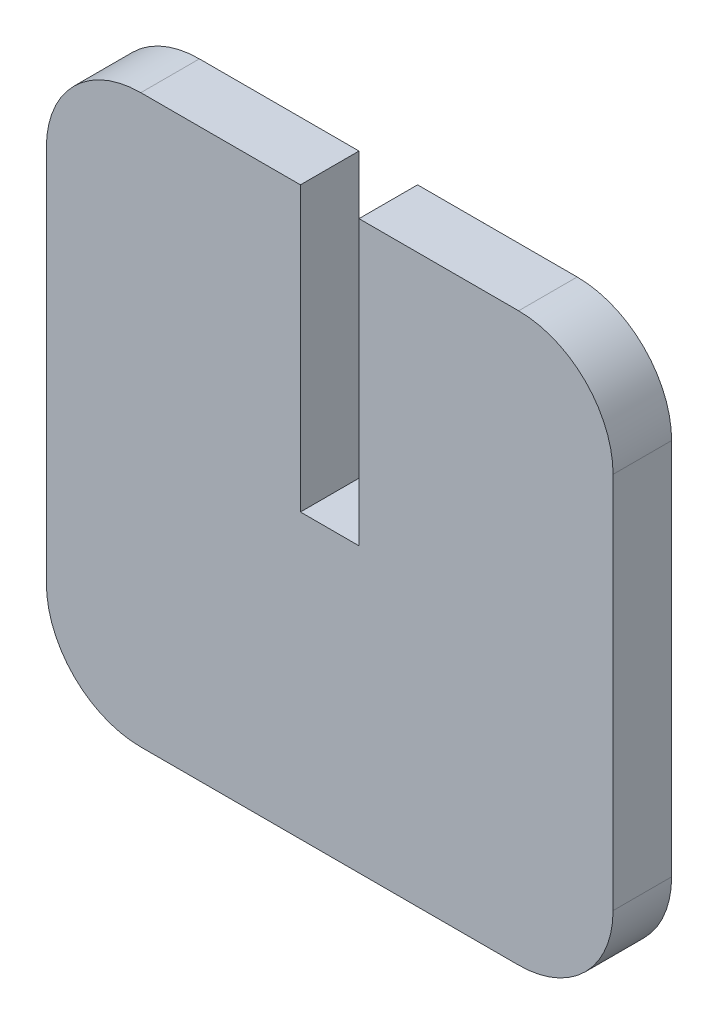
ISO-10303-21;
HEADER;
FILE_DESCRIPTION(('STEP AP214'),'2;1');
FILE_NAME('part.step','',(''),(''),'','','');
FILE_SCHEMA(('AUTOMOTIVE_DESIGN { 1 0 10303 214 1 1 1 1 }'));
ENDSEC;
DATA;
#1=APPLICATION_CONTEXT('core data for automotive mechanical design processes');
#2=APPLICATION_PROTOCOL_DEFINITION('international standard','automotive_design',2000,#1);
#3=PRODUCT_CONTEXT('',#1,'mechanical');
#4=PRODUCT('Part','Part','',(#3));
#5=PRODUCT_RELATED_PRODUCT_CATEGORY('part','',(#4));
#6=PRODUCT_DEFINITION_FORMATION('','',#4);
#7=PRODUCT_DEFINITION_CONTEXT('part definition',#1,'design');
#8=PRODUCT_DEFINITION('design','',#6,#7);
#9=PRODUCT_DEFINITION_SHAPE('','',#8);
#10=(LENGTH_UNIT() NAMED_UNIT(*) SI_UNIT(.MILLI.,.METRE.));
#11=(NAMED_UNIT(*) PLANE_ANGLE_UNIT() SI_UNIT($,.RADIAN.));
#12=(NAMED_UNIT(*) SI_UNIT($,.STERADIAN.) SOLID_ANGLE_UNIT());
#13=UNCERTAINTY_MEASURE_WITH_UNIT(LENGTH_MEASURE(1.E-05),#10,'distance_accuracy_value','');
#14=(GEOMETRIC_REPRESENTATION_CONTEXT(3) GLOBAL_UNCERTAINTY_ASSIGNED_CONTEXT((#13)) GLOBAL_UNIT_ASSIGNED_CONTEXT((#10,
#11,#12)) REPRESENTATION_CONTEXT('',''));
#15=CARTESIAN_POINT('',(0.,0.,0.));
#16=DIRECTION('',(0.,0.,1.));
#17=DIRECTION('',(1.,0.,0.));
#18=AXIS2_PLACEMENT_3D('',#15,#16,#17);
#19=CARTESIAN_POINT('',(-15.,15.,3.1));
#20=DIRECTION('',(0.,-1.,0.));
#21=DIRECTION('',(0.,0.,-1.));
#22=AXIS2_PLACEMENT_3D('',#19,#20,#21);
#23=PLANE('',#22);
#24=DIRECTION('',(-1.,0.,0.));
#25=VECTOR('',#24,1.);
#26=CARTESIAN_POINT('',(-15.,15.,3.1));
#27=LINE('',#26,#25);
#28=CARTESIAN_POINT('',(10.,15.,3.1));
#29=VERTEX_POINT('',#28);
#30=CARTESIAN_POINT('',(1.55,15.,3.1));
#31=VERTEX_POINT('',#30);
#32=EDGE_CURVE('E158',#29,#31,#27,.T.);
#33=ORIENTED_EDGE('',*,*,#32,.F.);
#34=DIRECTION('',(0.,0.,-1.));
#35=VECTOR('',#34,1.);
#36=CARTESIAN_POINT('',(10.,15.,3.1));
#37=LINE('',#36,#35);
#38=CARTESIAN_POINT('',(10.,15.,0.));
#39=VERTEX_POINT('',#38);
#40=EDGE_CURVE('E199',#29,#39,#37,.T.);
#41=ORIENTED_EDGE('',*,*,#40,.T.);
#42=DIRECTION('',(-1.,0.,0.));
#43=VECTOR('',#42,1.);
#44=CARTESIAN_POINT('',(-15.,15.,0.));
#45=LINE('',#44,#43);
#46=CARTESIAN_POINT('',(1.55,15.,0.));
#47=VERTEX_POINT('',#46);
#48=EDGE_CURVE('E169',#39,#47,#45,.T.);
#49=ORIENTED_EDGE('',*,*,#48,.T.);
#50=DIRECTION('',(0.,0.,-1.));
#51=VECTOR('',#50,1.);
#52=CARTESIAN_POINT('',(1.55,15.,3.1));
#53=LINE('',#52,#51);
#54=EDGE_CURVE('E235',#31,#47,#53,.T.);
#55=ORIENTED_EDGE('',*,*,#54,.F.);
#56=EDGE_LOOP('',(#33,#41,#49,#55));
#57=FACE_BOUND('',#56,.T.);
#58=ADVANCED_FACE('F32',(#57),#23,.F.);
#59=CARTESIAN_POINT('',(15.,-15.,3.1));
#60=DIRECTION('',(-1.,0.,0.));
#61=DIRECTION('',(0.,0.,1.));
#62=AXIS2_PLACEMENT_3D('',#59,#60,#61);
#63=PLANE('',#62);
#64=DIRECTION('',(0.,1.,0.));
#65=VECTOR('',#64,1.);
#66=CARTESIAN_POINT('',(15.,-15.,3.1));
#67=LINE('',#66,#65);
#68=CARTESIAN_POINT('',(15.,-10.,3.1));
#69=VERTEX_POINT('',#68);
#70=CARTESIAN_POINT('',(15.,10.,3.1));
#71=VERTEX_POINT('',#70);
#72=EDGE_CURVE('E153',#69,#71,#67,.T.);
#73=ORIENTED_EDGE('',*,*,#72,.F.);
#74=DIRECTION('',(0.,0.,-1.));
#75=VECTOR('',#74,1.);
#76=CARTESIAN_POINT('',(15.,-10.,3.1));
#77=LINE('',#76,#75);
#78=CARTESIAN_POINT('',(15.,-10.,0.));
#79=VERTEX_POINT('',#78);
#80=EDGE_CURVE('E176',#69,#79,#77,.T.);
#81=ORIENTED_EDGE('',*,*,#80,.T.);
#82=DIRECTION('',(0.,1.,0.));
#83=VECTOR('',#82,1.);
#84=CARTESIAN_POINT('',(15.,-15.,0.));
#85=LINE('',#84,#83);
#86=CARTESIAN_POINT('',(15.,10.,0.));
#87=VERTEX_POINT('',#86);
#88=EDGE_CURVE('E166',#79,#87,#85,.T.);
#89=ORIENTED_EDGE('',*,*,#88,.T.);
#90=DIRECTION('',(0.,0.,-1.));
#91=VECTOR('',#90,1.);
#92=CARTESIAN_POINT('',(15.,10.,3.1));
#93=LINE('',#92,#91);
#94=EDGE_CURVE('E165',#87,#71,#93,.F.);
#95=ORIENTED_EDGE('',*,*,#94,.T.);
#96=EDGE_LOOP('',(#73,#81,#89,#95));
#97=FACE_BOUND('',#96,.T.);
#98=ADVANCED_FACE('F224',(#97),#63,.F.);
#99=CARTESIAN_POINT('',(-1.55,15.,0.));
#100=VERTEX_POINT('',#99);
#101=CARTESIAN_POINT('',(-10.,15.,0.));
#102=VERTEX_POINT('',#101);
#103=EDGE_CURVE('E145',#100,#102,#45,.T.);
#104=ORIENTED_EDGE('',*,*,#103,.T.);
#105=DIRECTION('',(0.,0.,-1.));
#106=VECTOR('',#105,1.);
#107=CARTESIAN_POINT('',(-10.,15.,3.1));
#108=LINE('',#107,#106);
#109=CARTESIAN_POINT('',(-10.,15.,3.1));
#110=VERTEX_POINT('',#109);
#111=EDGE_CURVE('E11',#102,#110,#108,.F.);
#112=ORIENTED_EDGE('',*,*,#111,.T.);
#113=CARTESIAN_POINT('',(-1.55,15.,3.1));
#114=VERTEX_POINT('',#113);
#115=EDGE_CURVE('E156',#114,#110,#27,.T.);
#116=ORIENTED_EDGE('',*,*,#115,.F.);
#117=DIRECTION('',(0.,0.,1.));
#118=VECTOR('',#117,1.);
#119=CARTESIAN_POINT('',(-1.55,15.,3.1));
#120=LINE('',#119,#118);
#121=EDGE_CURVE('E241',#100,#114,#120,.T.);
#122=ORIENTED_EDGE('',*,*,#121,.F.);
#123=EDGE_LOOP('',(#104,#112,#116,#122));
#124=FACE_BOUND('',#123,.T.);
#125=ADVANCED_FACE('F247',(#124),#23,.F.);
#126=CARTESIAN_POINT('',(-15.,-15.,3.1));
#127=DIRECTION('',(1.,0.,0.));
#128=DIRECTION('',(0.,0.,-1.));
#129=AXIS2_PLACEMENT_3D('',#126,#127,#128);
#130=PLANE('',#129);
#131=DIRECTION('',(0.,-1.,0.));
#132=VECTOR('',#131,1.);
#133=CARTESIAN_POINT('',(-15.,-15.,0.));
#134=LINE('',#133,#132);
#135=CARTESIAN_POINT('',(-15.,10.,0.));
#136=VERTEX_POINT('',#135);
#137=CARTESIAN_POINT('',(-15.,-10.,0.));
#138=VERTEX_POINT('',#137);
#139=EDGE_CURVE('E171',#136,#138,#134,.T.);
#140=ORIENTED_EDGE('',*,*,#139,.T.);
#141=DIRECTION('',(0.,0.,-1.));
#142=VECTOR('',#141,1.);
#143=CARTESIAN_POINT('',(-15.,-10.,3.1));
#144=LINE('',#143,#142);
#145=CARTESIAN_POINT('',(-15.,-10.,3.1));
#146=VERTEX_POINT('',#145);
#147=EDGE_CURVE('E40',#138,#146,#144,.F.);
#148=ORIENTED_EDGE('',*,*,#147,.T.);
#149=DIRECTION('',(0.,-1.,0.));
#150=VECTOR('',#149,1.);
#151=CARTESIAN_POINT('',(-15.,-15.,3.1));
#152=LINE('',#151,#150);
#153=CARTESIAN_POINT('',(-15.,10.,3.1));
#154=VERTEX_POINT('',#153);
#155=EDGE_CURVE('E160',#154,#146,#152,.T.);
#156=ORIENTED_EDGE('',*,*,#155,.F.);
#157=DIRECTION('',(0.,0.,-1.));
#158=VECTOR('',#157,1.);
#159=CARTESIAN_POINT('',(-15.,10.,3.1));
#160=LINE('',#159,#158);
#161=EDGE_CURVE('E202',#154,#136,#160,.T.);
#162=ORIENTED_EDGE('',*,*,#161,.T.);
#163=EDGE_LOOP('',(#140,#148,#156,#162));
#164=FACE_BOUND('',#163,.T.);
#165=ADVANCED_FACE('F206',(#164),#130,.F.);
#166=CARTESIAN_POINT('',(-15.,-15.,3.1));
#167=DIRECTION('',(0.,1.,0.));
#168=DIRECTION('',(0.,0.,1.));
#169=AXIS2_PLACEMENT_3D('',#166,#167,#168);
#170=PLANE('',#169);
#171=DIRECTION('',(1.,0.,0.));
#172=VECTOR('',#171,1.);
#173=CARTESIAN_POINT('',(-15.,-15.,0.));
#174=LINE('',#173,#172);
#175=CARTESIAN_POINT('',(-10.,-15.,0.));
#176=VERTEX_POINT('',#175);
#177=CARTESIAN_POINT('',(10.,-15.,0.));
#178=VERTEX_POINT('',#177);
#179=EDGE_CURVE('E157',#176,#178,#174,.T.);
#180=ORIENTED_EDGE('',*,*,#179,.T.);
#181=DIRECTION('',(0.,0.,-1.));
#182=VECTOR('',#181,1.);
#183=CARTESIAN_POINT('',(10.,-15.,3.1));
#184=LINE('',#183,#182);
#185=CARTESIAN_POINT('',(10.,-15.,3.1));
#186=VERTEX_POINT('',#185);
#187=EDGE_CURVE('E190',#178,#186,#184,.F.);
#188=ORIENTED_EDGE('',*,*,#187,.T.);
#189=DIRECTION('',(1.,0.,0.));
#190=VECTOR('',#189,1.);
#191=CARTESIAN_POINT('',(-15.,-15.,3.1));
#192=LINE('',#191,#190);
#193=CARTESIAN_POINT('',(-10.,-15.,3.1));
#194=VERTEX_POINT('',#193);
#195=EDGE_CURVE('E162',#194,#186,#192,.T.);
#196=ORIENTED_EDGE('',*,*,#195,.F.);
#197=DIRECTION('',(0.,0.,-1.));
#198=VECTOR('',#197,1.);
#199=CARTESIAN_POINT('',(-10.,-15.,3.1));
#200=LINE('',#199,#198);
#201=EDGE_CURVE('E187',#194,#176,#200,.T.);
#202=ORIENTED_EDGE('',*,*,#201,.T.);
#203=EDGE_LOOP('',(#180,#188,#196,#202));
#204=FACE_BOUND('',#203,.T.);
#205=ADVANCED_FACE('F215',(#204),#170,.F.);
#206=CARTESIAN_POINT('',(0.,0.,3.1));
#207=DIRECTION('',(0.,0.,-1.));
#208=DIRECTION('',(-1.,0.,0.));
#209=AXIS2_PLACEMENT_3D('',#206,#207,#208);
#210=PLANE('',#209);
#211=ORIENTED_EDGE('',*,*,#195,.T.);
#212=CARTESIAN_POINT('',(10.,-10.,3.1));
#213=DIRECTION('',(0.,0.,-1.));
#214=DIRECTION('',(-1.,0.,0.));
#215=AXIS2_PLACEMENT_3D('',#212,#213,#214);
#216=CIRCLE('',#215,5.);
#217=EDGE_CURVE('E197',#186,#69,#216,.F.);
#218=ORIENTED_EDGE('',*,*,#217,.T.);
#219=ORIENTED_EDGE('',*,*,#72,.T.);
#220=CARTESIAN_POINT('',(10.,10.,3.1));
#221=DIRECTION('',(0.,0.,-1.));
#222=DIRECTION('',(-1.,0.,0.));
#223=AXIS2_PLACEMENT_3D('',#220,#221,#222);
#224=CIRCLE('',#223,5.);
#225=EDGE_CURVE('E195',#71,#29,#224,.F.);
#226=ORIENTED_EDGE('',*,*,#225,.T.);
#227=ORIENTED_EDGE('',*,*,#32,.T.);
#228=DIRECTION('',(0.,1.,0.));
#229=VECTOR('',#228,1.);
#230=CARTESIAN_POINT('',(1.55,0.,3.1));
#231=LINE('',#230,#229);
#232=CARTESIAN_POINT('',(1.55,0.,3.1));
#233=VERTEX_POINT('',#232);
#234=EDGE_CURVE('E148',#233,#31,#231,.T.);
#235=ORIENTED_EDGE('',*,*,#234,.F.);
#236=DIRECTION('',(1.,0.,0.));
#237=VECTOR('',#236,1.);
#238=CARTESIAN_POINT('',(-1.55,0.,3.1));
#239=LINE('',#238,#237);
#240=CARTESIAN_POINT('',(-1.55,0.,3.1));
#241=VERTEX_POINT('',#240);
#242=EDGE_CURVE('E131',#241,#233,#239,.T.);
#243=ORIENTED_EDGE('',*,*,#242,.F.);
#244=DIRECTION('',(0.,1.,0.));
#245=VECTOR('',#244,1.);
#246=CARTESIAN_POINT('',(-1.55,0.,3.1));
#247=LINE('',#246,#245);
#248=EDGE_CURVE('E127',#241,#114,#247,.T.);
#249=ORIENTED_EDGE('',*,*,#248,.T.);
#250=ORIENTED_EDGE('',*,*,#115,.T.);
#251=CARTESIAN_POINT('',(-10.,10.,3.1));
#252=DIRECTION('',(0.,0.,-1.));
#253=DIRECTION('',(-1.,0.,0.));
#254=AXIS2_PLACEMENT_3D('',#251,#252,#253);
#255=CIRCLE('',#254,5.);
#256=EDGE_CURVE('E53',#110,#154,#255,.F.);
#257=ORIENTED_EDGE('',*,*,#256,.T.);
#258=ORIENTED_EDGE('',*,*,#155,.T.);
#259=CARTESIAN_POINT('',(-10.,-10.,3.1));
#260=DIRECTION('',(0.,0.,-1.));
#261=DIRECTION('',(-1.,0.,0.));
#262=AXIS2_PLACEMENT_3D('',#259,#260,#261);
#263=CIRCLE('',#262,5.);
#264=EDGE_CURVE('E193',#146,#194,#263,.F.);
#265=ORIENTED_EDGE('',*,*,#264,.T.);
#266=EDGE_LOOP('',(#211,#218,#219,#226,#227,#235,#243,#249,#250,#257,#258,#265));
#267=FACE_BOUND('',#266,.T.);
#268=ADVANCED_FACE('F218',(#267),#210,.F.);
#269=CARTESIAN_POINT('',(0.,0.,0.));
#270=DIRECTION('',(0.,0.,-1.));
#271=DIRECTION('',(-1.,0.,0.));
#272=AXIS2_PLACEMENT_3D('',#269,#270,#271);
#273=PLANE('',#272);
#274=ORIENTED_EDGE('',*,*,#88,.F.);
#275=CARTESIAN_POINT('',(10.,-10.,0.));
#276=DIRECTION('',(0.,0.,-1.));
#277=DIRECTION('',(-1.,0.,0.));
#278=AXIS2_PLACEMENT_3D('',#275,#276,#277);
#279=CIRCLE('',#278,5.);
#280=EDGE_CURVE('E185',#79,#178,#279,.T.);
#281=ORIENTED_EDGE('',*,*,#280,.T.);
#282=ORIENTED_EDGE('',*,*,#179,.F.);
#283=CARTESIAN_POINT('',(-10.,-10.,0.));
#284=DIRECTION('',(0.,0.,-1.));
#285=DIRECTION('',(-1.,0.,0.));
#286=AXIS2_PLACEMENT_3D('',#283,#284,#285);
#287=CIRCLE('',#286,5.);
#288=EDGE_CURVE('E181',#176,#138,#287,.T.);
#289=ORIENTED_EDGE('',*,*,#288,.T.);
#290=ORIENTED_EDGE('',*,*,#139,.F.);
#291=CARTESIAN_POINT('',(-10.,10.,0.));
#292=DIRECTION('',(0.,0.,-1.));
#293=DIRECTION('',(-1.,0.,0.));
#294=AXIS2_PLACEMENT_3D('',#291,#292,#293);
#295=CIRCLE('',#294,5.);
#296=EDGE_CURVE('E179',#136,#102,#295,.T.);
#297=ORIENTED_EDGE('',*,*,#296,.T.);
#298=ORIENTED_EDGE('',*,*,#103,.F.);
#299=DIRECTION('',(0.,1.,0.));
#300=VECTOR('',#299,1.);
#301=CARTESIAN_POINT('',(-1.55,0.,0.));
#302=LINE('',#301,#300);
#303=CARTESIAN_POINT('',(-1.55,0.,0.));
#304=VERTEX_POINT('',#303);
#305=EDGE_CURVE('E124',#304,#100,#302,.T.);
#306=ORIENTED_EDGE('',*,*,#305,.F.);
#307=DIRECTION('',(-1.,0.,0.));
#308=VECTOR('',#307,1.);
#309=CARTESIAN_POINT('',(-1.55,0.,0.));
#310=LINE('',#309,#308);
#311=CARTESIAN_POINT('',(1.55,0.,0.));
#312=VERTEX_POINT('',#311);
#313=EDGE_CURVE('E132',#312,#304,#310,.T.);
#314=ORIENTED_EDGE('',*,*,#313,.F.);
#315=DIRECTION('',(0.,1.,0.));
#316=VECTOR('',#315,1.);
#317=CARTESIAN_POINT('',(1.55,0.,0.));
#318=LINE('',#317,#316);
#319=EDGE_CURVE('E146',#312,#47,#318,.T.);
#320=ORIENTED_EDGE('',*,*,#319,.T.);
#321=ORIENTED_EDGE('',*,*,#48,.F.);
#322=CARTESIAN_POINT('',(10.,10.,0.));
#323=DIRECTION('',(0.,0.,-1.));
#324=DIRECTION('',(-1.,0.,0.));
#325=AXIS2_PLACEMENT_3D('',#322,#323,#324);
#326=CIRCLE('',#325,5.);
#327=EDGE_CURVE('E183',#39,#87,#326,.T.);
#328=ORIENTED_EDGE('',*,*,#327,.T.);
#329=EDGE_LOOP('',(#274,#281,#282,#289,#290,#297,#298,#306,#314,#320,#321,#328));
#330=FACE_BOUND('',#329,.T.);
#331=ADVANCED_FACE('F143',(#330),#273,.T.);
#332=CARTESIAN_POINT('',(1.55,0.,3.1));
#333=DIRECTION('',(1.,0.,0.));
#334=DIRECTION('',(0.,0.,-1.));
#335=AXIS2_PLACEMENT_3D('',#332,#333,#334);
#336=PLANE('',#335);
#337=ORIENTED_EDGE('',*,*,#54,.T.);
#338=ORIENTED_EDGE('',*,*,#319,.F.);
#339=DIRECTION('',(0.,0.,-1.));
#340=VECTOR('',#339,1.);
#341=CARTESIAN_POINT('',(1.55,0.,3.1));
#342=LINE('',#341,#340);
#343=EDGE_CURVE('E136',#233,#312,#342,.T.);
#344=ORIENTED_EDGE('',*,*,#343,.F.);
#345=ORIENTED_EDGE('',*,*,#234,.T.);
#346=EDGE_LOOP('',(#337,#338,#344,#345));
#347=FACE_BOUND('',#346,.T.);
#348=ADVANCED_FACE('F239',(#347),#336,.F.);
#349=CARTESIAN_POINT('',(-1.55,0.,3.1));
#350=DIRECTION('',(-1.,0.,0.));
#351=DIRECTION('',(0.,0.,1.));
#352=AXIS2_PLACEMENT_3D('',#349,#350,#351);
#353=PLANE('',#352);
#354=ORIENTED_EDGE('',*,*,#121,.T.);
#355=ORIENTED_EDGE('',*,*,#248,.F.);
#356=DIRECTION('',(0.,0.,1.));
#357=VECTOR('',#356,1.);
#358=CARTESIAN_POINT('',(-1.55,0.,3.1));
#359=LINE('',#358,#357);
#360=EDGE_CURVE('E120',#304,#241,#359,.T.);
#361=ORIENTED_EDGE('',*,*,#360,.F.);
#362=ORIENTED_EDGE('',*,*,#305,.T.);
#363=EDGE_LOOP('',(#354,#355,#361,#362));
#364=FACE_BOUND('',#363,.T.);
#365=ADVANCED_FACE('F122',(#364),#353,.F.);
#366=CARTESIAN_POINT('',(0.,0.,0.));
#367=DIRECTION('',(0.,-1.,0.));
#368=DIRECTION('',(0.,0.,-1.));
#369=AXIS2_PLACEMENT_3D('',#366,#367,#368);
#370=PLANE('',#369);
#371=ORIENTED_EDGE('',*,*,#343,.T.);
#372=ORIENTED_EDGE('',*,*,#313,.T.);
#373=ORIENTED_EDGE('',*,*,#360,.T.);
#374=ORIENTED_EDGE('',*,*,#242,.T.);
#375=EDGE_LOOP('',(#371,#372,#373,#374));
#376=FACE_BOUND('',#375,.T.);
#377=ADVANCED_FACE('F135',(#376),#370,.F.);
#378=CARTESIAN_POINT('',(10.,-10.,3.1));
#379=DIRECTION('',(0.,0.,-1.));
#380=DIRECTION('',(-1.,0.,0.));
#381=AXIS2_PLACEMENT_3D('',#378,#379,#380);
#382=CYLINDRICAL_SURFACE('',#381,5.);
#383=ORIENTED_EDGE('',*,*,#217,.F.);
#384=ORIENTED_EDGE('',*,*,#187,.F.);
#385=ORIENTED_EDGE('',*,*,#280,.F.);
#386=ORIENTED_EDGE('',*,*,#80,.F.);
#387=EDGE_LOOP('',(#383,#384,#385,#386));
#388=FACE_BOUND('',#387,.T.);
#389=ADVANCED_FACE('F222',(#388),#382,.T.);
#390=CARTESIAN_POINT('',(10.,10.,3.1));
#391=DIRECTION('',(0.,0.,-1.));
#392=DIRECTION('',(-1.,0.,0.));
#393=AXIS2_PLACEMENT_3D('',#390,#391,#392);
#394=CYLINDRICAL_SURFACE('',#393,5.);
#395=ORIENTED_EDGE('',*,*,#225,.F.);
#396=ORIENTED_EDGE('',*,*,#94,.F.);
#397=ORIENTED_EDGE('',*,*,#327,.F.);
#398=ORIENTED_EDGE('',*,*,#40,.F.);
#399=EDGE_LOOP('',(#395,#396,#397,#398));
#400=FACE_BOUND('',#399,.T.);
#401=ADVANCED_FACE('F230',(#400),#394,.T.);
#402=CARTESIAN_POINT('',(-10.,-10.,3.1));
#403=DIRECTION('',(0.,0.,-1.));
#404=DIRECTION('',(-1.,0.,0.));
#405=AXIS2_PLACEMENT_3D('',#402,#403,#404);
#406=CYLINDRICAL_SURFACE('',#405,5.);
#407=ORIENTED_EDGE('',*,*,#264,.F.);
#408=ORIENTED_EDGE('',*,*,#147,.F.);
#409=ORIENTED_EDGE('',*,*,#288,.F.);
#410=ORIENTED_EDGE('',*,*,#201,.F.);
#411=EDGE_LOOP('',(#407,#408,#409,#410));
#412=FACE_BOUND('',#411,.T.);
#413=ADVANCED_FACE('F212',(#412),#406,.T.);
#414=CARTESIAN_POINT('',(-10.,10.,3.1));
#415=DIRECTION('',(0.,0.,-1.));
#416=DIRECTION('',(-1.,0.,0.));
#417=AXIS2_PLACEMENT_3D('',#414,#415,#416);
#418=CYLINDRICAL_SURFACE('',#417,5.);
#419=ORIENTED_EDGE('',*,*,#256,.F.);
#420=ORIENTED_EDGE('',*,*,#111,.F.);
#421=ORIENTED_EDGE('',*,*,#296,.F.);
#422=ORIENTED_EDGE('',*,*,#161,.F.);
#423=EDGE_LOOP('',(#419,#420,#421,#422));
#424=FACE_BOUND('',#423,.T.);
#425=ADVANCED_FACE('F34',(#424),#418,.T.);
#426=CLOSED_SHELL('',(#58,#98,#125,#165,#205,#268,#331,#348,#365,#377,#389,#401,#413,#425));
#427=MANIFOLD_SOLID_BREP('B2',#426);
#428=ADVANCED_BREP_SHAPE_REPRESENTATION('',(#18,#427),#14);
#429=SHAPE_DEFINITION_REPRESENTATION(#9,#428);
ENDSEC;
END-ISO-10303-21;
